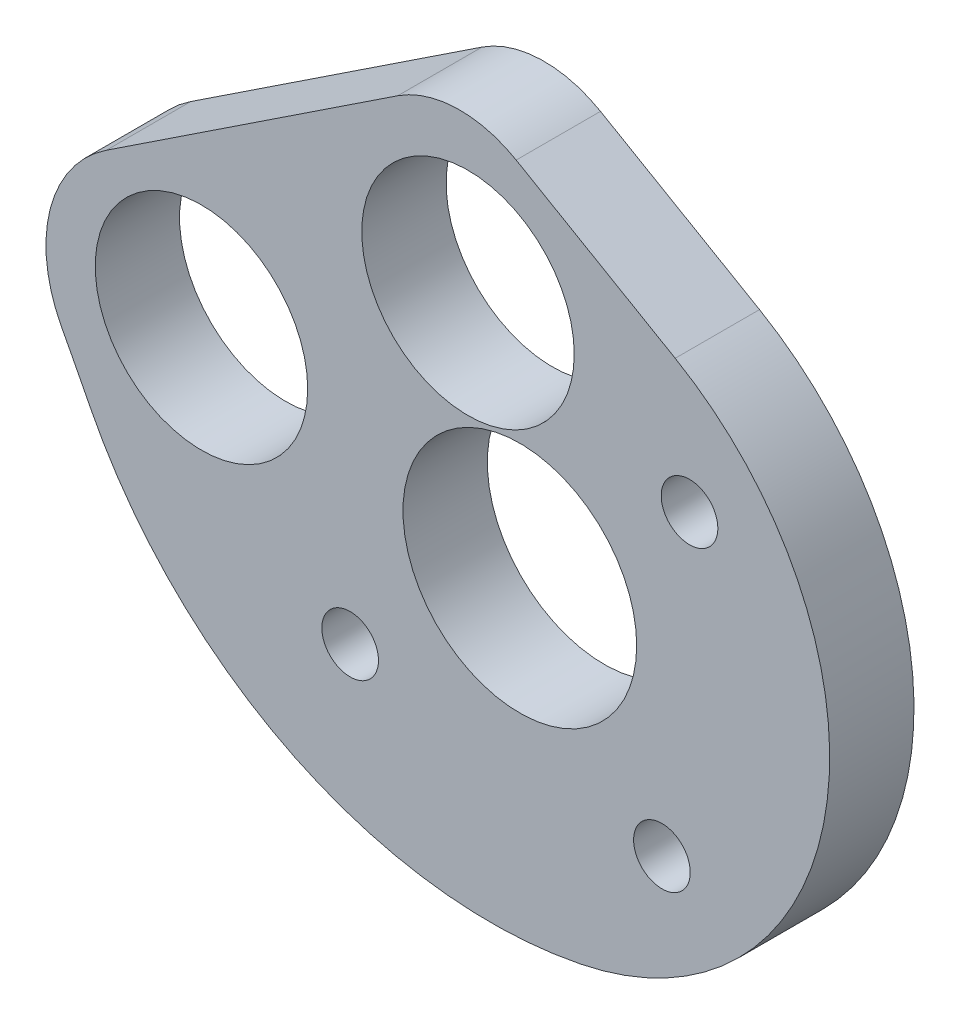
ISO-10303-21;
HEADER;
FILE_DESCRIPTION(('STEP AP214'),'2;1');
FILE_NAME('part.step','',(''),(''),'','','');
FILE_SCHEMA(('AUTOMOTIVE_DESIGN { 1 0 10303 214 1 1 1 1 }'));
ENDSEC;
DATA;
#1=APPLICATION_CONTEXT('core data for automotive mechanical design processes');
#2=APPLICATION_PROTOCOL_DEFINITION('international standard','automotive_design',2000,#1);
#3=PRODUCT_CONTEXT('',#1,'mechanical');
#4=PRODUCT('Part','Part','',(#3));
#5=PRODUCT_RELATED_PRODUCT_CATEGORY('part','',(#4));
#6=PRODUCT_DEFINITION_FORMATION('','',#4);
#7=PRODUCT_DEFINITION_CONTEXT('part definition',#1,'design');
#8=PRODUCT_DEFINITION('design','',#6,#7);
#9=PRODUCT_DEFINITION_SHAPE('','',#8);
#10=(LENGTH_UNIT() NAMED_UNIT(*) SI_UNIT(.MILLI.,.METRE.));
#11=(NAMED_UNIT(*) PLANE_ANGLE_UNIT() SI_UNIT($,.RADIAN.));
#12=(NAMED_UNIT(*) SI_UNIT($,.STERADIAN.) SOLID_ANGLE_UNIT());
#13=UNCERTAINTY_MEASURE_WITH_UNIT(LENGTH_MEASURE(1.E-05),#10,'distance_accuracy_value','');
#14=(GEOMETRIC_REPRESENTATION_CONTEXT(3) GLOBAL_UNCERTAINTY_ASSIGNED_CONTEXT((#13)) GLOBAL_UNIT_ASSIGNED_CONTEXT((#10,
#11,#12)) REPRESENTATION_CONTEXT('',''));
#15=CARTESIAN_POINT('',(0.,0.,0.));
#16=DIRECTION('',(0.,0.,1.));
#17=DIRECTION('',(1.,0.,0.));
#18=AXIS2_PLACEMENT_3D('',#15,#16,#17);
#19=CARTESIAN_POINT('',(199.108501581965,109.205374954862,4.7625));
#20=DIRECTION('',(0.,0.,1.));
#21=DIRECTION('',(1.,0.,0.));
#22=AXIS2_PLACEMENT_3D('',#19,#20,#21);
#23=PLANE('',#22);
#24=CARTESIAN_POINT('',(210.523861298363,84.7693783836398,4.7625));
#25=DIRECTION('',(0.,0.,1.));
#26=DIRECTION('',(1.,0.,0.));
#27=AXIS2_PLACEMENT_3D('',#24,#25,#26);
#28=CIRCLE('',#27,1.60000000000052);
#29=CARTESIAN_POINT('',(212.123861298363,84.7693783836398,4.7625));
#30=VERTEX_POINT('',#29);
#31=EDGE_CURVE('E206',#30,#30,#28,.T.);
#32=ORIENTED_EDGE('',*,*,#31,.F.);
#33=EDGE_LOOP('',(#32));
#34=FACE_BOUND('',#33,.T.);
#35=CARTESIAN_POINT('',(184.517388008827,97.6188558220968,4.7625));
#36=DIRECTION('',(0.,0.,1.));
#37=DIRECTION('',(1.,0.,0.));
#38=AXIS2_PLACEMENT_3D('',#35,#36,#37);
#39=CIRCLE('',#38,6.00075000000033);
#40=CARTESIAN_POINT('',(190.518138008827,97.6188558220968,4.7625));
#41=VERTEX_POINT('',#40);
#42=EDGE_CURVE('E191',#41,#41,#39,.T.);
#43=ORIENTED_EDGE('',*,*,#42,.F.);
#44=EDGE_LOOP('',(#43));
#45=FACE_BOUND('',#44,.T.);
#46=CARTESIAN_POINT('',(199.571302743401,106.841754977501,4.7625));
#47=DIRECTION('',(0.,0.,1.));
#48=DIRECTION('',(1.,0.,0.));
#49=AXIS2_PLACEMENT_3D('',#46,#47,#48);
#50=CIRCLE('',#49,6.00075000000046);
#51=CARTESIAN_POINT('',(205.572052743402,106.841754977501,4.7625));
#52=VERTEX_POINT('',#51);
#53=EDGE_CURVE('E139',#52,#52,#50,.T.);
#54=ORIENTED_EDGE('',*,*,#53,.F.);
#55=EDGE_LOOP('',(#54));
#56=FACE_BOUND('',#55,.T.);
#57=CARTESIAN_POINT('',(199.108501581965,109.205374954862,4.7625));
#58=DIRECTION('',(0.,0.,1.));
#59=DIRECTION('',(1.,0.,0.));
#60=AXIS2_PLACEMENT_3D('',#57,#58,#59);
#61=CIRCLE('',#60,6.35000000000013);
#62=CARTESIAN_POINT('',(202.292483354534,114.699440851077,4.7625));
#63=VERTEX_POINT('',#62);
#64=CARTESIAN_POINT('',(195.603327805889,114.500302414187,4.7625));
#65=VERTEX_POINT('',#64);
#66=EDGE_CURVE('E151',#63,#65,#61,.T.);
#67=ORIENTED_EDGE('',*,*,#66,.T.);
#68=DIRECTION('',(-0.833846843988184,-0.55199587024809,0.));
#69=VECTOR('',#68,1.);
#70=CARTESIAN_POINT('',(179.148086510863,103.607144630743,4.7625));
#71=LINE('',#70,#69);
#72=CARTESIAN_POINT('',(179.148086510863,103.607144630742,4.7625));
#73=VERTEX_POINT('',#72);
#74=EDGE_CURVE('E98',#65,#73,#71,.T.);
#75=ORIENTED_EDGE('',*,*,#74,.T.);
#76=CARTESIAN_POINT('',(183.354295042153,97.2532316795526,4.7625));
#77=DIRECTION('',(0.,0.,1.));
#78=DIRECTION('',(1.,0.,0.));
#79=AXIS2_PLACEMENT_3D('',#76,#77,#78);
#80=CIRCLE('',#79,7.61999999999997);
#81=CARTESIAN_POINT('',(176.6226161507,93.6826715971055,4.7625));
#82=VERTEX_POINT('',#81);
#83=EDGE_CURVE('E168',#73,#82,#80,.T.);
#84=ORIENTED_EDGE('',*,*,#83,.T.);
#85=CARTESIAN_POINT('',(-2.9964919434633E-10,-1.44398382140309E-10,4.7625));
#86=DIRECTION('',(0.,0.,-1.));
#87=DIRECTION('',(-1.,0.,0.));
#88=AXIS2_PLACEMENT_3D('',#85,#86,#87);
#89=CIRCLE('',#88,199.929966472317);
#90=CARTESIAN_POINT('',(178.234639917329,90.5781686005439,4.7625));
#91=VERTEX_POINT('',#90);
#92=EDGE_CURVE('E177',#82,#91,#89,.T.);
#93=ORIENTED_EDGE('',*,*,#92,.T.);
#94=CARTESIAN_POINT('',(200.878368287757,102.085625551856,4.7625));
#95=DIRECTION('',(0.,0.,1.));
#96=DIRECTION('',(-1.,0.,0.));
#97=AXIS2_PLACEMENT_3D('',#94,#95,#96);
#98=CIRCLE('',#97,25.4);
#99=CARTESIAN_POINT('',(205.873802068245,77.1816973206562,4.7625));
#100=VERTEX_POINT('',#99);
#101=EDGE_CURVE('E119',#91,#100,#98,.T.);
#102=ORIENTED_EDGE('',*,*,#101,.T.);
#103=DIRECTION('',(0.980469615401583,0.19667062127901,0.));
#104=VECTOR('',#103,1.);
#105=CARTESIAN_POINT('',(205.873802068245,77.1816973206562,4.7625));
#106=LINE('',#105,#104);
#107=CARTESIAN_POINT('',(205.940797495733,77.195135811906,4.7625));
#108=VERTEX_POINT('',#107);
#109=EDGE_CURVE('E115',#100,#108,#106,.T.);
#110=ORIENTED_EDGE('',*,*,#109,.T.);
#111=CARTESIAN_POINT('',(202.499061623349,94.3533540814337,4.7625));
#112=DIRECTION('',(0.,0.,1.));
#113=DIRECTION('',(1.,0.,0.));
#114=AXIS2_PLACEMENT_3D('',#111,#112,#113);
#115=CIRCLE('',#114,17.5000000000001);
#116=CARTESIAN_POINT('',(211.273814539878,109.494480567064,4.7625));
#117=VERTEX_POINT('',#116);
#118=EDGE_CURVE('E116',#108,#117,#115,.T.);
#119=ORIENTED_EDGE('',*,*,#118,.T.);
#120=DIRECTION('',(-0.865207227750315,0.501414452373099,0.));
#121=VECTOR('',#120,1.);
#122=CARTESIAN_POINT('',(202.292483354534,114.699440851077,4.7625));
#123=LINE('',#122,#121);
#124=EDGE_CURVE('E57',#117,#63,#123,.T.);
#125=ORIENTED_EDGE('',*,*,#124,.T.);
#126=EDGE_LOOP('',(#67,#75,#84,#93,#102,#110,#119,#125));
#127=FACE_BOUND('',#126,.T.);
#128=CARTESIAN_POINT('',(212.083037321144,102.378153756446,4.7625));
#129=DIRECTION('',(0.,0.,1.));
#130=DIRECTION('',(1.,0.,0.));
#131=AXIS2_PLACEMENT_3D('',#128,#129,#130);
#132=CIRCLE('',#131,1.59999999999999);
#133=CARTESIAN_POINT('',(213.683037321144,102.378153756446,4.7625));
#134=VERTEX_POINT('',#133);
#135=EDGE_CURVE('E187',#134,#134,#132,.T.);
#136=ORIENTED_EDGE('',*,*,#135,.F.);
#137=EDGE_LOOP('',(#136));
#138=FACE_BOUND('',#137,.T.);
#139=CARTESIAN_POINT('',(202.499061623349,94.3533540814337,4.7625));
#140=DIRECTION('',(0.,0.,1.));
#141=DIRECTION('',(1.,0.,0.));
#142=AXIS2_PLACEMENT_3D('',#139,#140,#141);
#143=CIRCLE('',#142,6.60000000000011);
#144=CARTESIAN_POINT('',(209.09906162335,94.3533540814337,4.7625));
#145=VERTEX_POINT('',#144);
#146=EDGE_CURVE('E200',#145,#145,#143,.T.);
#147=ORIENTED_EDGE('',*,*,#146,.F.);
#148=EDGE_LOOP('',(#147));
#149=FACE_BOUND('',#148,.T.);
#150=CARTESIAN_POINT('',(192.915085925557,86.3285544064181,4.7625));
#151=DIRECTION('',(0.,0.,1.));
#152=DIRECTION('',(1.,0.,0.));
#153=AXIS2_PLACEMENT_3D('',#150,#151,#152);
#154=CIRCLE('',#153,1.59999999999999);
#155=CARTESIAN_POINT('',(194.515085925557,86.3285544064181,4.7625));
#156=VERTEX_POINT('',#155);
#157=EDGE_CURVE('E212',#156,#156,#154,.T.);
#158=ORIENTED_EDGE('',*,*,#157,.F.);
#159=EDGE_LOOP('',(#158));
#160=FACE_BOUND('',#159,.T.);
#161=ADVANCED_FACE('F39',(#34,#45,#56,#127,#138,#149,#160),#23,.T.);
#162=CARTESIAN_POINT('',(199.108501581965,109.205374954862,0.));
#163=DIRECTION('',(0.,0.,1.));
#164=DIRECTION('',(1.,0.,0.));
#165=AXIS2_PLACEMENT_3D('',#162,#163,#164);
#166=PLANE('',#165);
#167=CARTESIAN_POINT('',(199.108501581965,109.205374954862,0.));
#168=DIRECTION('',(0.,0.,1.));
#169=DIRECTION('',(1.,0.,0.));
#170=AXIS2_PLACEMENT_3D('',#167,#168,#169);
#171=CIRCLE('',#170,6.35000000000013);
#172=CARTESIAN_POINT('',(202.292483354534,114.699440851077,0.));
#173=VERTEX_POINT('',#172);
#174=CARTESIAN_POINT('',(195.603327805889,114.500302414187,0.));
#175=VERTEX_POINT('',#174);
#176=EDGE_CURVE('E136',#173,#175,#171,.T.);
#177=ORIENTED_EDGE('',*,*,#176,.F.);
#178=DIRECTION('',(-0.865207227750315,0.501414452373099,0.));
#179=VECTOR('',#178,1.);
#180=CARTESIAN_POINT('',(202.292483354534,114.699440851077,0.));
#181=LINE('',#180,#179);
#182=CARTESIAN_POINT('',(211.273814539878,109.494480567064,0.));
#183=VERTEX_POINT('',#182);
#184=EDGE_CURVE('E91',#183,#173,#181,.T.);
#185=ORIENTED_EDGE('',*,*,#184,.F.);
#186=CARTESIAN_POINT('',(202.499061623349,94.3533540814337,0.));
#187=DIRECTION('',(0.,0.,1.));
#188=DIRECTION('',(1.,0.,0.));
#189=AXIS2_PLACEMENT_3D('',#186,#187,#188);
#190=CIRCLE('',#189,17.5000000000001);
#191=CARTESIAN_POINT('',(205.940797495733,77.195135811906,0.));
#192=VERTEX_POINT('',#191);
#193=EDGE_CURVE('E82',#192,#183,#190,.T.);
#194=ORIENTED_EDGE('',*,*,#193,.F.);
#195=DIRECTION('',(0.980469615401583,0.19667062127901,0.));
#196=VECTOR('',#195,1.);
#197=CARTESIAN_POINT('',(205.873802068245,77.1816973206562,0.));
#198=LINE('',#197,#196);
#199=CARTESIAN_POINT('',(205.873802068245,77.1816973206562,0.));
#200=VERTEX_POINT('',#199);
#201=EDGE_CURVE('E128',#200,#192,#198,.T.);
#202=ORIENTED_EDGE('',*,*,#201,.F.);
#203=CARTESIAN_POINT('',(200.878368287757,102.085625551856,0.));
#204=DIRECTION('',(0.,0.,1.));
#205=DIRECTION('',(-1.,0.,0.));
#206=AXIS2_PLACEMENT_3D('',#203,#204,#205);
#207=CIRCLE('',#206,25.4);
#208=CARTESIAN_POINT('',(178.234639917329,90.5781686005439,0.));
#209=VERTEX_POINT('',#208);
#210=EDGE_CURVE('E147',#209,#200,#207,.T.);
#211=ORIENTED_EDGE('',*,*,#210,.F.);
#212=CARTESIAN_POINT('',(-2.9964919434633E-10,-1.44398382140309E-10,0.));
#213=DIRECTION('',(0.,0.,-1.));
#214=DIRECTION('',(-1.,0.,0.));
#215=AXIS2_PLACEMENT_3D('',#212,#213,#214);
#216=CIRCLE('',#215,199.929966472317);
#217=CARTESIAN_POINT('',(176.6226161507,93.6826715971055,0.));
#218=VERTEX_POINT('',#217);
#219=EDGE_CURVE('E143',#218,#209,#216,.T.);
#220=ORIENTED_EDGE('',*,*,#219,.F.);
#221=CARTESIAN_POINT('',(183.354295042153,97.2532316795526,0.));
#222=DIRECTION('',(0.,0.,1.));
#223=DIRECTION('',(1.,0.,0.));
#224=AXIS2_PLACEMENT_3D('',#221,#222,#223);
#225=CIRCLE('',#224,7.61999999999997);
#226=CARTESIAN_POINT('',(179.148086510863,103.607144630742,0.));
#227=VERTEX_POINT('',#226);
#228=EDGE_CURVE('E145',#227,#218,#225,.T.);
#229=ORIENTED_EDGE('',*,*,#228,.F.);
#230=DIRECTION('',(-0.833846843988184,-0.55199587024809,0.));
#231=VECTOR('',#230,1.);
#232=CARTESIAN_POINT('',(179.148086510863,103.607144630743,0.));
#233=LINE('',#232,#231);
#234=EDGE_CURVE('E137',#175,#227,#233,.T.);
#235=ORIENTED_EDGE('',*,*,#234,.F.);
#236=EDGE_LOOP('',(#177,#185,#194,#202,#211,#220,#229,#235));
#237=FACE_BOUND('',#236,.T.);
#238=CARTESIAN_POINT('',(199.571302743401,106.841754977501,0.));
#239=DIRECTION('',(0.,0.,1.));
#240=DIRECTION('',(1.,0.,0.));
#241=AXIS2_PLACEMENT_3D('',#238,#239,#240);
#242=CIRCLE('',#241,6.00075000000046);
#243=CARTESIAN_POINT('',(205.572052743402,106.841754977501,0.));
#244=VERTEX_POINT('',#243);
#245=EDGE_CURVE('E184',#244,#244,#242,.T.);
#246=ORIENTED_EDGE('',*,*,#245,.T.);
#247=EDGE_LOOP('',(#246));
#248=FACE_BOUND('',#247,.T.);
#249=CARTESIAN_POINT('',(212.083037321144,102.378153756446,0.));
#250=DIRECTION('',(0.,0.,1.));
#251=DIRECTION('',(1.,0.,0.));
#252=AXIS2_PLACEMENT_3D('',#249,#250,#251);
#253=CIRCLE('',#252,1.59999999999999);
#254=CARTESIAN_POINT('',(213.683037321144,102.378153756446,0.));
#255=VERTEX_POINT('',#254);
#256=EDGE_CURVE('E192',#255,#255,#253,.T.);
#257=ORIENTED_EDGE('',*,*,#256,.T.);
#258=EDGE_LOOP('',(#257));
#259=FACE_BOUND('',#258,.T.);
#260=CARTESIAN_POINT('',(184.517388008827,97.6188558220968,0.));
#261=DIRECTION('',(0.,0.,1.));
#262=DIRECTION('',(1.,0.,0.));
#263=AXIS2_PLACEMENT_3D('',#260,#261,#262);
#264=CIRCLE('',#263,6.00075000000033);
#265=CARTESIAN_POINT('',(190.518138008827,97.6188558220968,0.));
#266=VERTEX_POINT('',#265);
#267=EDGE_CURVE('E197',#266,#266,#264,.T.);
#268=ORIENTED_EDGE('',*,*,#267,.T.);
#269=EDGE_LOOP('',(#268));
#270=FACE_BOUND('',#269,.T.);
#271=CARTESIAN_POINT('',(202.499061623349,94.3533540814337,0.));
#272=DIRECTION('',(0.,0.,1.));
#273=DIRECTION('',(1.,0.,0.));
#274=AXIS2_PLACEMENT_3D('',#271,#272,#273);
#275=CIRCLE('',#274,6.60000000000011);
#276=CARTESIAN_POINT('',(209.09906162335,94.3533540814337,0.));
#277=VERTEX_POINT('',#276);
#278=EDGE_CURVE('E201',#277,#277,#275,.T.);
#279=ORIENTED_EDGE('',*,*,#278,.T.);
#280=EDGE_LOOP('',(#279));
#281=FACE_BOUND('',#280,.T.);
#282=CARTESIAN_POINT('',(210.523861298363,84.7693783836398,0.));
#283=DIRECTION('',(0.,0.,1.));
#284=DIRECTION('',(1.,0.,0.));
#285=AXIS2_PLACEMENT_3D('',#282,#283,#284);
#286=CIRCLE('',#285,1.60000000000052);
#287=CARTESIAN_POINT('',(212.123861298363,84.7693783836398,0.));
#288=VERTEX_POINT('',#287);
#289=EDGE_CURVE('E208',#288,#288,#286,.T.);
#290=ORIENTED_EDGE('',*,*,#289,.T.);
#291=EDGE_LOOP('',(#290));
#292=FACE_BOUND('',#291,.T.);
#293=CARTESIAN_POINT('',(192.915085925557,86.3285544064181,0.));
#294=DIRECTION('',(0.,0.,1.));
#295=DIRECTION('',(1.,0.,0.));
#296=AXIS2_PLACEMENT_3D('',#293,#294,#295);
#297=CIRCLE('',#296,1.59999999999999);
#298=CARTESIAN_POINT('',(194.515085925557,86.3285544064181,0.));
#299=VERTEX_POINT('',#298);
#300=EDGE_CURVE('E214',#299,#299,#297,.T.);
#301=ORIENTED_EDGE('',*,*,#300,.T.);
#302=EDGE_LOOP('',(#301));
#303=FACE_BOUND('',#302,.T.);
#304=ADVANCED_FACE('F169',(#237,#248,#259,#270,#281,#292,#303),#166,.F.);
#305=CARTESIAN_POINT('',(199.108501581965,109.205374954862,4.7625));
#306=DIRECTION('',(0.,0.,-1.));
#307=DIRECTION('',(-1.,0.,0.));
#308=AXIS2_PLACEMENT_3D('',#305,#306,#307);
#309=CYLINDRICAL_SURFACE('',#308,6.35000000000013);
#310=ORIENTED_EDGE('',*,*,#176,.T.);
#311=DIRECTION('',(0.,0.,-1.));
#312=VECTOR('',#311,1.);
#313=CARTESIAN_POINT('',(195.603327805889,114.500302414187,4.7625));
#314=LINE('',#313,#312);
#315=EDGE_CURVE('E11',#65,#175,#314,.T.);
#316=ORIENTED_EDGE('',*,*,#315,.F.);
#317=ORIENTED_EDGE('',*,*,#66,.F.);
#318=DIRECTION('',(0.,0.,-1.));
#319=VECTOR('',#318,1.);
#320=CARTESIAN_POINT('',(202.292483354534,114.699440851077,4.7625));
#321=LINE('',#320,#319);
#322=EDGE_CURVE('E135',#63,#173,#321,.T.);
#323=ORIENTED_EDGE('',*,*,#322,.T.);
#324=EDGE_LOOP('',(#310,#316,#317,#323));
#325=FACE_BOUND('',#324,.T.);
#326=ADVANCED_FACE('F41',(#325),#309,.T.);
#327=CARTESIAN_POINT('',(179.148086510863,103.607144630743,4.7625));
#328=DIRECTION('',(0.55199587024809,-0.833846843988184,0.));
#329=DIRECTION('',(0.833846843988184,0.55199587024809,0.));
#330=AXIS2_PLACEMENT_3D('',#327,#328,#329);
#331=PLANE('',#330);
#332=ORIENTED_EDGE('',*,*,#234,.T.);
#333=DIRECTION('',(0.,0.,-1.));
#334=VECTOR('',#333,1.);
#335=CARTESIAN_POINT('',(179.148086510863,103.607144630742,4.7625));
#336=LINE('',#335,#334);
#337=EDGE_CURVE('E48',#73,#227,#336,.T.);
#338=ORIENTED_EDGE('',*,*,#337,.F.);
#339=ORIENTED_EDGE('',*,*,#74,.F.);
#340=ORIENTED_EDGE('',*,*,#315,.T.);
#341=EDGE_LOOP('',(#332,#338,#339,#340));
#342=FACE_BOUND('',#341,.T.);
#343=ADVANCED_FACE('F249',(#342),#331,.F.);
#344=CARTESIAN_POINT('',(183.354295042153,97.2532316795526,4.7625));
#345=DIRECTION('',(0.,0.,-1.));
#346=DIRECTION('',(-1.,0.,0.));
#347=AXIS2_PLACEMENT_3D('',#344,#345,#346);
#348=CYLINDRICAL_SURFACE('',#347,7.61999999999997);
#349=ORIENTED_EDGE('',*,*,#228,.T.);
#350=DIRECTION('',(0.,0.,-1.));
#351=VECTOR('',#350,1.);
#352=CARTESIAN_POINT('',(176.6226161507,93.6826715971055,4.7625));
#353=LINE('',#352,#351);
#354=EDGE_CURVE('E156',#82,#218,#353,.T.);
#355=ORIENTED_EDGE('',*,*,#354,.F.);
#356=ORIENTED_EDGE('',*,*,#83,.F.);
#357=ORIENTED_EDGE('',*,*,#337,.T.);
#358=EDGE_LOOP('',(#349,#355,#356,#357));
#359=FACE_BOUND('',#358,.T.);
#360=ADVANCED_FACE('F163',(#359),#348,.T.);
#361=CARTESIAN_POINT('',(-2.9964919434633E-10,-1.44398382140309E-10,4.7625));
#362=DIRECTION('',(0.,0.,-1.));
#363=DIRECTION('',(-1.,0.,0.));
#364=AXIS2_PLACEMENT_3D('',#361,#362,#363);
#365=CYLINDRICAL_SURFACE('',#364,199.929966472317);
#366=ORIENTED_EDGE('',*,*,#219,.T.);
#367=DIRECTION('',(0.,0.,-1.));
#368=VECTOR('',#367,1.);
#369=CARTESIAN_POINT('',(178.234639917329,90.5781686005439,4.7625));
#370=LINE('',#369,#368);
#371=EDGE_CURVE('E155',#91,#209,#370,.T.);
#372=ORIENTED_EDGE('',*,*,#371,.F.);
#373=ORIENTED_EDGE('',*,*,#92,.F.);
#374=ORIENTED_EDGE('',*,*,#354,.T.);
#375=EDGE_LOOP('',(#366,#372,#373,#374));
#376=FACE_BOUND('',#375,.T.);
#377=ADVANCED_FACE('F172',(#376),#365,.F.);
#378=CARTESIAN_POINT('',(200.878368287757,102.085625551856,4.7625));
#379=DIRECTION('',(0.,0.,-1.));
#380=DIRECTION('',(-1.,0.,0.));
#381=AXIS2_PLACEMENT_3D('',#378,#379,#380);
#382=CYLINDRICAL_SURFACE('',#381,25.4);
#383=ORIENTED_EDGE('',*,*,#210,.T.);
#384=DIRECTION('',(0.,0.,-1.));
#385=VECTOR('',#384,1.);
#386=CARTESIAN_POINT('',(205.873802068245,77.1816973206562,4.7625));
#387=LINE('',#386,#385);
#388=EDGE_CURVE('E130',#100,#200,#387,.T.);
#389=ORIENTED_EDGE('',*,*,#388,.F.);
#390=ORIENTED_EDGE('',*,*,#101,.F.);
#391=ORIENTED_EDGE('',*,*,#371,.T.);
#392=EDGE_LOOP('',(#383,#389,#390,#391));
#393=FACE_BOUND('',#392,.T.);
#394=ADVANCED_FACE('F178',(#393),#382,.T.);
#395=CARTESIAN_POINT('',(205.873802068245,77.1816973206562,4.7625));
#396=DIRECTION('',(-0.19667062127901,0.980469615401583,0.));
#397=DIRECTION('',(-0.980469615401583,-0.19667062127901,0.));
#398=AXIS2_PLACEMENT_3D('',#395,#396,#397);
#399=PLANE('',#398);
#400=ORIENTED_EDGE('',*,*,#201,.T.);
#401=DIRECTION('',(0.,0.,-1.));
#402=VECTOR('',#401,1.);
#403=CARTESIAN_POINT('',(205.940797495733,77.195135811906,4.7625));
#404=LINE('',#403,#402);
#405=EDGE_CURVE('E121',#108,#192,#404,.T.);
#406=ORIENTED_EDGE('',*,*,#405,.F.);
#407=ORIENTED_EDGE('',*,*,#109,.F.);
#408=ORIENTED_EDGE('',*,*,#388,.T.);
#409=EDGE_LOOP('',(#400,#406,#407,#408));
#410=FACE_BOUND('',#409,.T.);
#411=ADVANCED_FACE('F125',(#410),#399,.F.);
#412=CARTESIAN_POINT('',(202.499061623349,94.3533540814337,4.7625));
#413=DIRECTION('',(0.,0.,-1.));
#414=DIRECTION('',(-1.,0.,0.));
#415=AXIS2_PLACEMENT_3D('',#412,#413,#414);
#416=CYLINDRICAL_SURFACE('',#415,17.5000000000001);
#417=ORIENTED_EDGE('',*,*,#193,.T.);
#418=DIRECTION('',(0.,0.,-1.));
#419=VECTOR('',#418,1.);
#420=CARTESIAN_POINT('',(211.273814539878,109.494480567064,4.7625));
#421=LINE('',#420,#419);
#422=EDGE_CURVE('E126',#117,#183,#421,.T.);
#423=ORIENTED_EDGE('',*,*,#422,.F.);
#424=ORIENTED_EDGE('',*,*,#118,.F.);
#425=ORIENTED_EDGE('',*,*,#405,.T.);
#426=EDGE_LOOP('',(#417,#423,#424,#425));
#427=FACE_BOUND('',#426,.T.);
#428=ADVANCED_FACE('F127',(#427),#416,.T.);
#429=CARTESIAN_POINT('',(202.292483354534,114.699440851077,4.7625));
#430=DIRECTION('',(-0.501414452373099,-0.865207227750315,0.));
#431=DIRECTION('',(0.865207227750315,-0.501414452373099,0.));
#432=AXIS2_PLACEMENT_3D('',#429,#430,#431);
#433=PLANE('',#432);
#434=ORIENTED_EDGE('',*,*,#184,.T.);
#435=ORIENTED_EDGE('',*,*,#322,.F.);
#436=ORIENTED_EDGE('',*,*,#124,.F.);
#437=ORIENTED_EDGE('',*,*,#422,.T.);
#438=EDGE_LOOP('',(#434,#435,#436,#437));
#439=FACE_BOUND('',#438,.T.);
#440=ADVANCED_FACE('F240',(#439),#433,.F.);
#441=CARTESIAN_POINT('',(199.571302743401,106.841754977501,4.7625));
#442=DIRECTION('',(0.,0.,-1.));
#443=DIRECTION('',(-1.,0.,0.));
#444=AXIS2_PLACEMENT_3D('',#441,#442,#443);
#445=CYLINDRICAL_SURFACE('',#444,6.00075000000046);
#446=ORIENTED_EDGE('',*,*,#53,.T.);
#447=EDGE_LOOP('',(#446));
#448=FACE_BOUND('',#447,.T.);
#449=ORIENTED_EDGE('',*,*,#245,.F.);
#450=EDGE_LOOP('',(#449));
#451=FACE_BOUND('',#450,.T.);
#452=ADVANCED_FACE('F233',(#448,#451),#445,.F.);
#453=CARTESIAN_POINT('',(212.083037321144,102.378153756446,4.7625));
#454=DIRECTION('',(0.,0.,-1.));
#455=DIRECTION('',(-1.,0.,0.));
#456=AXIS2_PLACEMENT_3D('',#453,#454,#455);
#457=CYLINDRICAL_SURFACE('',#456,1.59999999999999);
#458=ORIENTED_EDGE('',*,*,#135,.T.);
#459=EDGE_LOOP('',(#458));
#460=FACE_BOUND('',#459,.T.);
#461=ORIENTED_EDGE('',*,*,#256,.F.);
#462=EDGE_LOOP('',(#461));
#463=FACE_BOUND('',#462,.T.);
#464=ADVANCED_FACE('F315',(#460,#463),#457,.F.);
#465=CARTESIAN_POINT('',(184.517388008827,97.6188558220968,4.7625));
#466=DIRECTION('',(0.,0.,-1.));
#467=DIRECTION('',(-1.,0.,0.));
#468=AXIS2_PLACEMENT_3D('',#465,#466,#467);
#469=CYLINDRICAL_SURFACE('',#468,6.00075000000033);
#470=ORIENTED_EDGE('',*,*,#42,.T.);
#471=EDGE_LOOP('',(#470));
#472=FACE_BOUND('',#471,.T.);
#473=ORIENTED_EDGE('',*,*,#267,.F.);
#474=EDGE_LOOP('',(#473));
#475=FACE_BOUND('',#474,.T.);
#476=ADVANCED_FACE('F319',(#472,#475),#469,.F.);
#477=CARTESIAN_POINT('',(202.499061623349,94.3533540814337,4.7625));
#478=DIRECTION('',(0.,0.,-1.));
#479=DIRECTION('',(-1.,0.,0.));
#480=AXIS2_PLACEMENT_3D('',#477,#478,#479);
#481=CYLINDRICAL_SURFACE('',#480,6.60000000000011);
#482=ORIENTED_EDGE('',*,*,#146,.T.);
#483=EDGE_LOOP('',(#482));
#484=FACE_BOUND('',#483,.T.);
#485=ORIENTED_EDGE('',*,*,#278,.F.);
#486=EDGE_LOOP('',(#485));
#487=FACE_BOUND('',#486,.T.);
#488=ADVANCED_FACE('F329',(#484,#487),#481,.F.);
#489=CARTESIAN_POINT('',(210.523861298363,84.7693783836398,4.7625));
#490=DIRECTION('',(0.,0.,-1.));
#491=DIRECTION('',(-1.,0.,0.));
#492=AXIS2_PLACEMENT_3D('',#489,#490,#491);
#493=CYLINDRICAL_SURFACE('',#492,1.60000000000052);
#494=ORIENTED_EDGE('',*,*,#31,.T.);
#495=EDGE_LOOP('',(#494));
#496=FACE_BOUND('',#495,.T.);
#497=ORIENTED_EDGE('',*,*,#289,.F.);
#498=EDGE_LOOP('',(#497));
#499=FACE_BOUND('',#498,.T.);
#500=ADVANCED_FACE('F340',(#496,#499),#493,.F.);
#501=CARTESIAN_POINT('',(192.915085925557,86.3285544064181,4.7625));
#502=DIRECTION('',(0.,0.,-1.));
#503=DIRECTION('',(-1.,0.,0.));
#504=AXIS2_PLACEMENT_3D('',#501,#502,#503);
#505=CYLINDRICAL_SURFACE('',#504,1.59999999999999);
#506=ORIENTED_EDGE('',*,*,#157,.T.);
#507=EDGE_LOOP('',(#506));
#508=FACE_BOUND('',#507,.T.);
#509=ORIENTED_EDGE('',*,*,#300,.F.);
#510=EDGE_LOOP('',(#509));
#511=FACE_BOUND('',#510,.T.);
#512=ADVANCED_FACE('F221',(#508,#511),#505,.F.);
#513=CLOSED_SHELL('',(#161,#304,#326,#343,#360,#377,#394,#411,#428,#440,#452,#464,#476,#488,
#500,#512));
#514=MANIFOLD_SOLID_BREP('B2',#513);
#515=ADVANCED_BREP_SHAPE_REPRESENTATION('',(#18,#514),#14);
#516=SHAPE_DEFINITION_REPRESENTATION(#9,#515);
ENDSEC;
END-ISO-10303-21;
